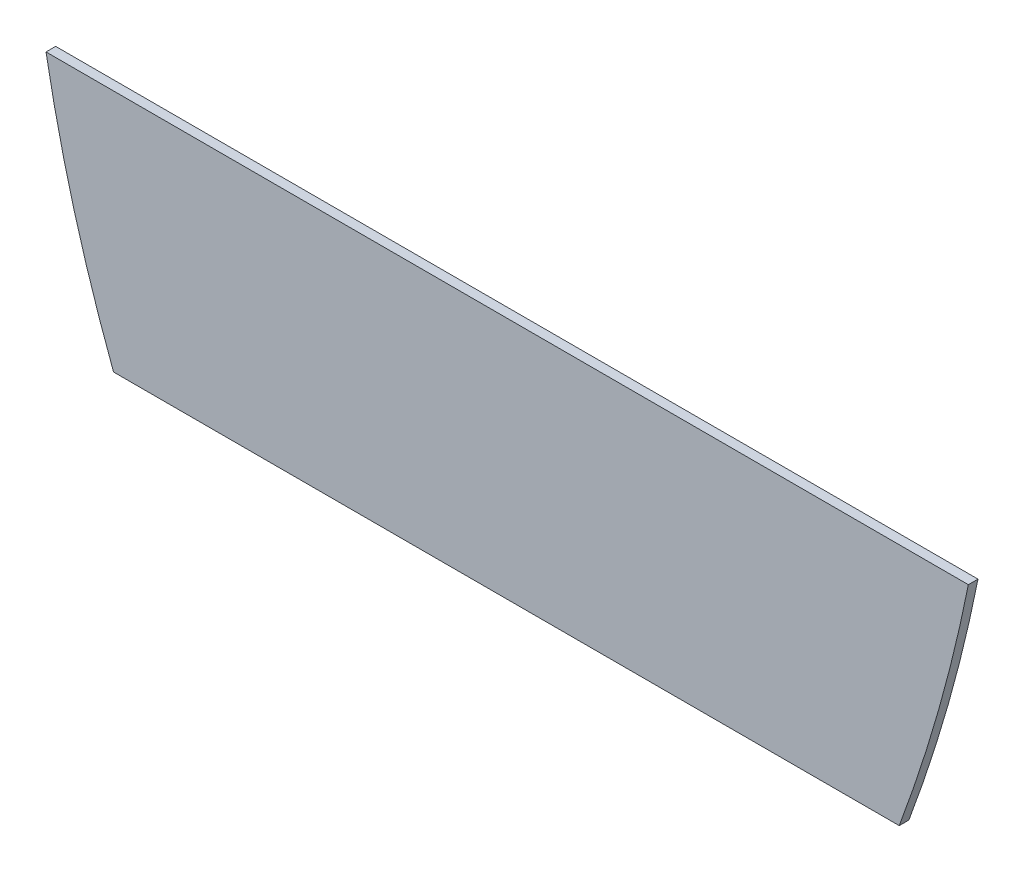
ISO-10303-21;
HEADER;
FILE_DESCRIPTION(('STEP AP214'),'2;1');
FILE_NAME('part.step','',(''),(''),'','','');
FILE_SCHEMA(('AUTOMOTIVE_DESIGN { 1 0 10303 214 1 1 1 1 }'));
ENDSEC;
DATA;
#1=APPLICATION_CONTEXT('core data for automotive mechanical design processes');
#2=APPLICATION_PROTOCOL_DEFINITION('international standard','automotive_design',2000,#1);
#3=PRODUCT_CONTEXT('',#1,'mechanical');
#4=PRODUCT('Part','Part','',(#3));
#5=PRODUCT_RELATED_PRODUCT_CATEGORY('part','',(#4));
#6=PRODUCT_DEFINITION_FORMATION('','',#4);
#7=PRODUCT_DEFINITION_CONTEXT('part definition',#1,'design');
#8=PRODUCT_DEFINITION('design','',#6,#7);
#9=PRODUCT_DEFINITION_SHAPE('','',#8);
#10=(LENGTH_UNIT() NAMED_UNIT(*) SI_UNIT(.MILLI.,.METRE.));
#11=(NAMED_UNIT(*) PLANE_ANGLE_UNIT() SI_UNIT($,.RADIAN.));
#12=(NAMED_UNIT(*) SI_UNIT($,.STERADIAN.) SOLID_ANGLE_UNIT());
#13=UNCERTAINTY_MEASURE_WITH_UNIT(LENGTH_MEASURE(1.E-05),#10,'distance_accuracy_value','');
#14=(GEOMETRIC_REPRESENTATION_CONTEXT(3) GLOBAL_UNCERTAINTY_ASSIGNED_CONTEXT((#13)) GLOBAL_UNIT_ASSIGNED_CONTEXT((#10,
#11,#12)) REPRESENTATION_CONTEXT('',''));
#15=CARTESIAN_POINT('',(0.,0.,0.));
#16=DIRECTION('',(0.,0.,1.));
#17=DIRECTION('',(1.,0.,0.));
#18=AXIS2_PLACEMENT_3D('',#15,#16,#17);
#19=CARTESIAN_POINT('',(0.,13.2913648569778,0.1));
#20=DIRECTION('',(0.,-1.,0.));
#21=DIRECTION('',(1.,0.,0.));
#22=AXIS2_PLACEMENT_3D('',#19,#20,#21);
#23=PLANE('',#22);
#24=DIRECTION('',(-1.,0.,0.));
#25=VECTOR('',#24,1.);
#26=CARTESIAN_POINT('',(0.,13.2913648569778,0.));
#27=LINE('',#26,#25);
#28=CARTESIAN_POINT('',(32.9215925203707,13.2913648569779,0.));
#29=VERTEX_POINT('',#28);
#30=CARTESIAN_POINT('',(24.7711751310374,13.2913648569779,0.));
#31=VERTEX_POINT('',#30);
#32=EDGE_CURVE('E95',#29,#31,#27,.T.);
#33=ORIENTED_EDGE('',*,*,#32,.F.);
#34=DIRECTION('',(0.,0.,-1.));
#35=VECTOR('',#34,1.);
#36=CARTESIAN_POINT('',(32.9215925203707,13.2913648569779,0.1));
#37=LINE('',#36,#35);
#38=CARTESIAN_POINT('',(32.9215925203707,13.2913648569779,0.1));
#39=VERTEX_POINT('',#38);
#40=EDGE_CURVE('E11',#39,#29,#37,.T.);
#41=ORIENTED_EDGE('',*,*,#40,.F.);
#42=DIRECTION('',(-1.,0.,0.));
#43=VECTOR('',#42,1.);
#44=CARTESIAN_POINT('',(0.,13.2913648569778,0.1));
#45=LINE('',#44,#43);
#46=CARTESIAN_POINT('',(24.7711751310374,13.2913648569779,0.1));
#47=VERTEX_POINT('',#46);
#48=EDGE_CURVE('E83',#39,#47,#45,.T.);
#49=ORIENTED_EDGE('',*,*,#48,.T.);
#50=DIRECTION('',(0.,0.,-1.));
#51=VECTOR('',#50,1.);
#52=CARTESIAN_POINT('',(24.7711751310374,13.2913648569779,0.1));
#53=LINE('',#52,#51);
#54=EDGE_CURVE('E72',#47,#31,#53,.T.);
#55=ORIENTED_EDGE('',*,*,#54,.T.);
#56=EDGE_LOOP('',(#33,#41,#49,#55));
#57=FACE_BOUND('',#56,.T.);
#58=ADVANCED_FACE('F33',(#57),#23,.T.);
#59=CARTESIAN_POINT('',(17.6303980903038,19.0004484242937,0.1));
#60=DIRECTION('',(0.,0.,-1.));
#61=DIRECTION('',(-1.,0.,0.));
#62=AXIS2_PLACEMENT_3D('',#59,#60,#61);
#63=CYLINDRICAL_SURFACE('',#62,16.3222015144007);
#64=CARTESIAN_POINT('',(17.6303980903038,19.0004484242937,0.));
#65=DIRECTION('',(0.,0.,1.));
#66=DIRECTION('',(1.,0.,0.));
#67=AXIS2_PLACEMENT_3D('',#64,#65,#66);
#68=CIRCLE('',#67,16.3222015144007);
#69=CARTESIAN_POINT('',(33.6387206717242,15.8148761984777,0.));
#70=VERTEX_POINT('',#69);
#71=EDGE_CURVE('E88',#29,#70,#68,.T.);
#72=ORIENTED_EDGE('',*,*,#71,.T.);
#73=DIRECTION('',(0.,0.,-1.));
#74=VECTOR('',#73,1.);
#75=CARTESIAN_POINT('',(33.6387206717242,15.8148761984777,0.1));
#76=LINE('',#75,#74);
#77=CARTESIAN_POINT('',(33.6387206717242,15.8148761984777,0.1));
#78=VERTEX_POINT('',#77);
#79=EDGE_CURVE('E41',#78,#70,#76,.T.);
#80=ORIENTED_EDGE('',*,*,#79,.F.);
#81=CARTESIAN_POINT('',(17.6303980903038,19.0004484242937,0.1));
#82=DIRECTION('',(0.,0.,1.));
#83=DIRECTION('',(1.,0.,0.));
#84=AXIS2_PLACEMENT_3D('',#81,#82,#83);
#85=CIRCLE('',#84,16.3222015144007);
#86=EDGE_CURVE('E78',#39,#78,#85,.T.);
#87=ORIENTED_EDGE('',*,*,#86,.F.);
#88=ORIENTED_EDGE('',*,*,#40,.T.);
#89=EDGE_LOOP('',(#72,#80,#87,#88));
#90=FACE_BOUND('',#89,.T.);
#91=ADVANCED_FACE('F86',(#90),#63,.T.);
#92=CARTESIAN_POINT('',(0.00333860365029921,15.821973619574,0.1));
#93=DIRECTION('',(-0.000211010563931321,-0.999999977737271,0.));
#94=DIRECTION('',(0.999999977737271,-0.000211010563931321,0.));
#95=AXIS2_PLACEMENT_3D('',#92,#93,#94);
#96=PLANE('',#95);
#97=DIRECTION('',(-0.999999977737271,0.000211010563931321,0.));
#98=VECTOR('',#97,1.);
#99=CARTESIAN_POINT('',(0.00333860365029921,15.821973619574,0.));
#100=LINE('',#99,#98);
#101=CARTESIAN_POINT('',(24.070459750793,15.8168952026555,0.));
#102=VERTEX_POINT('',#101);
#103=EDGE_CURVE('E65',#70,#102,#100,.T.);
#104=ORIENTED_EDGE('',*,*,#103,.T.);
#105=DIRECTION('',(0.,0.,-1.));
#106=VECTOR('',#105,1.);
#107=CARTESIAN_POINT('',(24.070459750793,15.8168952026555,0.1));
#108=LINE('',#107,#106);
#109=CARTESIAN_POINT('',(24.070459750793,15.8168952026555,0.1));
#110=VERTEX_POINT('',#109);
#111=EDGE_CURVE('E89',#110,#102,#108,.T.);
#112=ORIENTED_EDGE('',*,*,#111,.F.);
#113=DIRECTION('',(-0.999999977737271,0.000211010563931321,0.));
#114=VECTOR('',#113,1.);
#115=CARTESIAN_POINT('',(0.00333860365029921,15.821973619574,0.1));
#116=LINE('',#115,#114);
#117=EDGE_CURVE('E82',#78,#110,#116,.T.);
#118=ORIENTED_EDGE('',*,*,#117,.F.);
#119=ORIENTED_EDGE('',*,*,#79,.T.);
#120=EDGE_LOOP('',(#104,#112,#118,#119));
#121=FACE_BOUND('',#120,.T.);
#122=ADVANCED_FACE('F90',(#121),#96,.F.);
#123=CARTESIAN_POINT('',(38.1797980553508,18.3715972598266,0.1));
#124=DIRECTION('',(0.,0.,-1.));
#125=DIRECTION('',(-1.,0.,0.));
#126=AXIS2_PLACEMENT_3D('',#123,#124,#125);
#127=CYLINDRICAL_SURFACE('',#126,14.3387562219802);
#128=CARTESIAN_POINT('',(38.1797980553508,18.3715972598266,0.));
#129=DIRECTION('',(0.,0.,1.));
#130=DIRECTION('',(1.,0.,0.));
#131=AXIS2_PLACEMENT_3D('',#128,#129,#130);
#132=CIRCLE('',#131,14.3387562219802);
#133=EDGE_CURVE('E100',#102,#31,#132,.T.);
#134=ORIENTED_EDGE('',*,*,#133,.T.);
#135=ORIENTED_EDGE('',*,*,#54,.F.);
#136=CARTESIAN_POINT('',(38.1797980553508,18.3715972598266,0.1));
#137=DIRECTION('',(0.,0.,1.));
#138=DIRECTION('',(1.,0.,0.));
#139=AXIS2_PLACEMENT_3D('',#136,#137,#138);
#140=CIRCLE('',#139,14.3387562219802);
#141=EDGE_CURVE('E49',#110,#47,#140,.T.);
#142=ORIENTED_EDGE('',*,*,#141,.F.);
#143=ORIENTED_EDGE('',*,*,#111,.T.);
#144=EDGE_LOOP('',(#134,#135,#142,#143));
#145=FACE_BOUND('',#144,.T.);
#146=ADVANCED_FACE('F105',(#145),#127,.T.);
#147=CARTESIAN_POINT('',(0.,0.,0.1));
#148=DIRECTION('',(0.,0.,1.));
#149=DIRECTION('',(1.,0.,0.));
#150=AXIS2_PLACEMENT_3D('',#147,#148,#149);
#151=PLANE('',#150);
#152=ORIENTED_EDGE('',*,*,#48,.F.);
#153=ORIENTED_EDGE('',*,*,#86,.T.);
#154=ORIENTED_EDGE('',*,*,#117,.T.);
#155=ORIENTED_EDGE('',*,*,#141,.T.);
#156=EDGE_LOOP('',(#152,#153,#154,#155));
#157=FACE_BOUND('',#156,.T.);
#158=ADVANCED_FACE('F80',(#157),#151,.T.);
#159=CARTESIAN_POINT('',(0.,0.,0.));
#160=DIRECTION('',(0.,0.,1.));
#161=DIRECTION('',(1.,0.,0.));
#162=AXIS2_PLACEMENT_3D('',#159,#160,#161);
#163=PLANE('',#162);
#164=ORIENTED_EDGE('',*,*,#32,.T.);
#165=ORIENTED_EDGE('',*,*,#133,.F.);
#166=ORIENTED_EDGE('',*,*,#103,.F.);
#167=ORIENTED_EDGE('',*,*,#71,.F.);
#168=EDGE_LOOP('',(#164,#165,#166,#167));
#169=FACE_BOUND('',#168,.T.);
#170=ADVANCED_FACE('F107',(#169),#163,.F.);
#171=CLOSED_SHELL('',(#58,#91,#122,#146,#158,#170));
#172=MANIFOLD_SOLID_BREP('B2',#171);
#173=ADVANCED_BREP_SHAPE_REPRESENTATION('',(#18,#172),#14);
#174=SHAPE_DEFINITION_REPRESENTATION(#9,#173);
ENDSEC;
END-ISO-10303-21;
